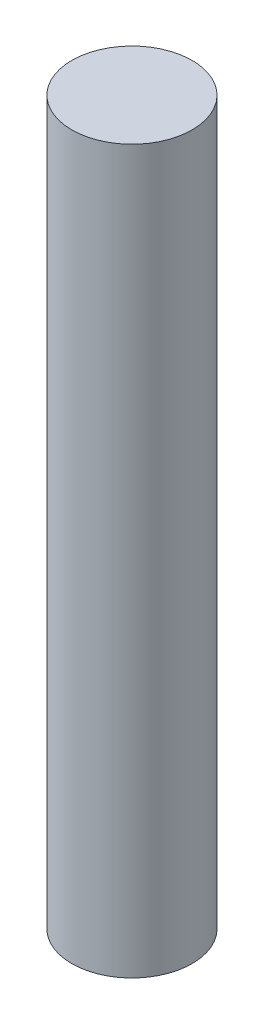
ISO-10303-21;
HEADER;
FILE_DESCRIPTION(('STEP AP214'),'2;1');
FILE_NAME('part.step','',(''),(''),'','','');
FILE_SCHEMA(('AUTOMOTIVE_DESIGN { 1 0 10303 214 1 1 1 1 }'));
ENDSEC;
DATA;
#1=APPLICATION_CONTEXT('core data for automotive mechanical design processes');
#2=APPLICATION_PROTOCOL_DEFINITION('international standard','automotive_design',2000,#1);
#3=PRODUCT_CONTEXT('',#1,'mechanical');
#4=PRODUCT('Part','Part','',(#3));
#5=PRODUCT_RELATED_PRODUCT_CATEGORY('part','',(#4));
#6=PRODUCT_DEFINITION_FORMATION('','',#4);
#7=PRODUCT_DEFINITION_CONTEXT('part definition',#1,'design');
#8=PRODUCT_DEFINITION('design','',#6,#7);
#9=PRODUCT_DEFINITION_SHAPE('','',#8);
#10=(LENGTH_UNIT() NAMED_UNIT(*) SI_UNIT(.MILLI.,.METRE.));
#11=(NAMED_UNIT(*) PLANE_ANGLE_UNIT() SI_UNIT($,.RADIAN.));
#12=(NAMED_UNIT(*) SI_UNIT($,.STERADIAN.) SOLID_ANGLE_UNIT());
#13=UNCERTAINTY_MEASURE_WITH_UNIT(LENGTH_MEASURE(1.E-05),#10,'distance_accuracy_value','');
#14=(GEOMETRIC_REPRESENTATION_CONTEXT(3) GLOBAL_UNCERTAINTY_ASSIGNED_CONTEXT((#13)) GLOBAL_UNIT_ASSIGNED_CONTEXT((#10,
#11,#12)) REPRESENTATION_CONTEXT('',''));
#15=CARTESIAN_POINT('',(0.,0.,0.));
#16=DIRECTION('',(0.,0.,1.));
#17=DIRECTION('',(1.,0.,0.));
#18=AXIS2_PLACEMENT_3D('',#15,#16,#17);
#19=CARTESIAN_POINT('',(0.,190.5,0.));
#20=DIRECTION('',(0.,-1.,0.));
#21=DIRECTION('',(0.,0.,-1.));
#22=AXIS2_PLACEMENT_3D('',#19,#20,#21);
#23=CYLINDRICAL_SURFACE('',#22,15.875);
#24=CARTESIAN_POINT('',(0.,190.5,0.));
#25=DIRECTION('',(0.,1.,0.));
#26=DIRECTION('',(0.,0.,1.));
#27=AXIS2_PLACEMENT_3D('',#24,#25,#26);
#28=CIRCLE('',#27,15.875);
#29=CARTESIAN_POINT('',(0.,190.5,15.875));
#30=VERTEX_POINT('',#29);
#31=EDGE_CURVE('E10',#30,#30,#28,.T.);
#32=ORIENTED_EDGE('',*,*,#31,.F.);
#33=EDGE_LOOP('',(#32));
#34=FACE_BOUND('',#33,.T.);
#35=CARTESIAN_POINT('',(0.,0.,0.));
#36=DIRECTION('',(0.,1.,0.));
#37=DIRECTION('',(0.,0.,1.));
#38=AXIS2_PLACEMENT_3D('',#35,#36,#37);
#39=CIRCLE('',#38,15.875);
#40=CARTESIAN_POINT('',(0.,0.,15.875));
#41=VERTEX_POINT('',#40);
#42=EDGE_CURVE('E35',#41,#41,#39,.T.);
#43=ORIENTED_EDGE('',*,*,#42,.T.);
#44=EDGE_LOOP('',(#43));
#45=FACE_BOUND('',#44,.T.);
#46=ADVANCED_FACE('F32',(#34,#45),#23,.T.);
#47=CARTESIAN_POINT('',(0.,190.5,0.));
#48=DIRECTION('',(0.,1.,0.));
#49=DIRECTION('',(0.,0.,1.));
#50=AXIS2_PLACEMENT_3D('',#47,#48,#49);
#51=PLANE('',#50);
#52=ORIENTED_EDGE('',*,*,#31,.T.);
#53=EDGE_LOOP('',(#52));
#54=FACE_BOUND('',#53,.T.);
#55=ADVANCED_FACE('F47',(#54),#51,.T.);
#56=CARTESIAN_POINT('',(0.,0.,0.));
#57=DIRECTION('',(0.,1.,0.));
#58=DIRECTION('',(0.,0.,1.));
#59=AXIS2_PLACEMENT_3D('',#56,#57,#58);
#60=PLANE('',#59);
#61=ORIENTED_EDGE('',*,*,#42,.F.);
#62=EDGE_LOOP('',(#61));
#63=FACE_BOUND('',#62,.T.);
#64=ADVANCED_FACE('F45',(#63),#60,.F.);
#65=CLOSED_SHELL('',(#46,#55,#64));
#66=MANIFOLD_SOLID_BREP('B2',#65);
#67=ADVANCED_BREP_SHAPE_REPRESENTATION('',(#18,#66),#14);
#68=SHAPE_DEFINITION_REPRESENTATION(#9,#67);
ENDSEC;
END-ISO-10303-21;
